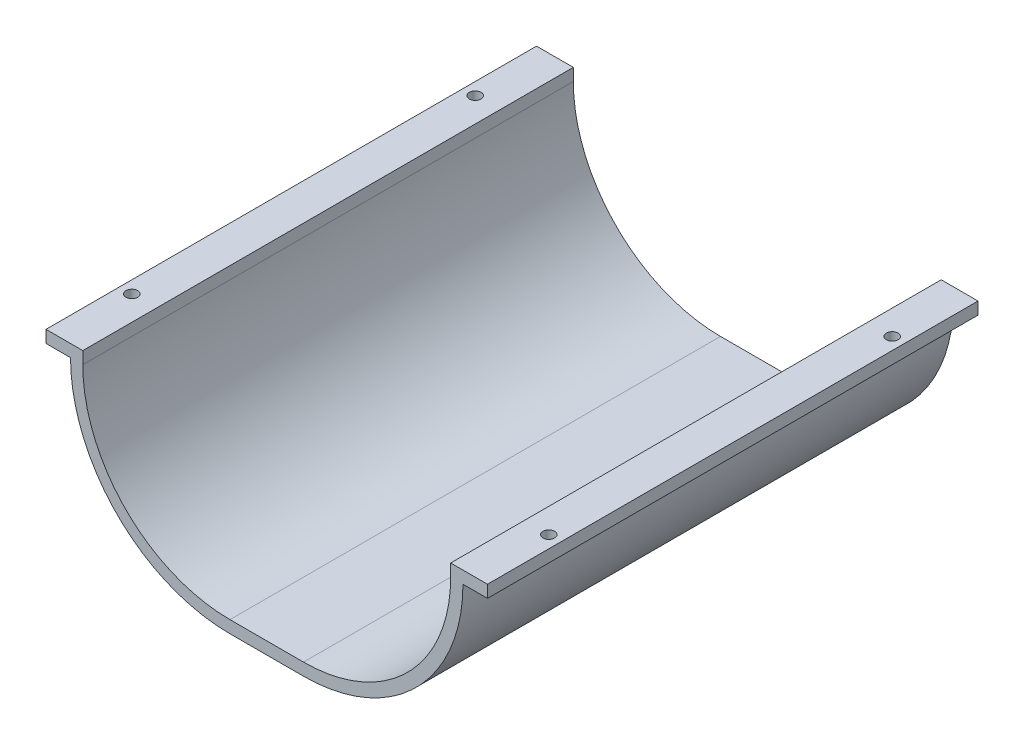
ISO-10303-21;
HEADER;
FILE_DESCRIPTION(('STEP AP214'),'2;1');
FILE_NAME('part.step','',(''),(''),'','','');
FILE_SCHEMA(('AUTOMOTIVE_DESIGN { 1 0 10303 214 1 1 1 1 }'));
ENDSEC;
DATA;
#1=APPLICATION_CONTEXT('core data for automotive mechanical design processes');
#2=APPLICATION_PROTOCOL_DEFINITION('international standard','automotive_design',2000,#1);
#3=PRODUCT_CONTEXT('',#1,'mechanical');
#4=PRODUCT('Part','Part','',(#3));
#5=PRODUCT_RELATED_PRODUCT_CATEGORY('part','',(#4));
#6=PRODUCT_DEFINITION_FORMATION('','',#4);
#7=PRODUCT_DEFINITION_CONTEXT('part definition',#1,'design');
#8=PRODUCT_DEFINITION('design','',#6,#7);
#9=PRODUCT_DEFINITION_SHAPE('','',#8);
#10=(LENGTH_UNIT() NAMED_UNIT(*) SI_UNIT(.MILLI.,.METRE.));
#11=(NAMED_UNIT(*) PLANE_ANGLE_UNIT() SI_UNIT($,.RADIAN.));
#12=(NAMED_UNIT(*) SI_UNIT($,.STERADIAN.) SOLID_ANGLE_UNIT());
#13=UNCERTAINTY_MEASURE_WITH_UNIT(LENGTH_MEASURE(1.E-05),#10,'distance_accuracy_value','');
#14=(GEOMETRIC_REPRESENTATION_CONTEXT(3) GLOBAL_UNCERTAINTY_ASSIGNED_CONTEXT((#13)) GLOBAL_UNIT_ASSIGNED_CONTEXT((#10,
#11,#12)) REPRESENTATION_CONTEXT('',''));
#15=CARTESIAN_POINT('',(0.,0.,0.));
#16=DIRECTION('',(0.,0.,1.));
#17=DIRECTION('',(1.,0.,0.));
#18=AXIS2_PLACEMENT_3D('',#15,#16,#17);
#19=CARTESIAN_POINT('',(-15.,0.,200.));
#20=DIRECTION('',(-1.,0.,0.));
#21=DIRECTION('',(0.,0.,1.));
#22=AXIS2_PLACEMENT_3D('',#19,#20,#21);
#23=PLANE('',#22);
#24=DIRECTION('',(0.,1.,0.));
#25=VECTOR('',#24,1.);
#26=CARTESIAN_POINT('',(-15.,0.,0.));
#27=LINE('',#26,#25);
#28=CARTESIAN_POINT('',(-15.,60.,0.));
#29=VERTEX_POINT('',#28);
#30=CARTESIAN_POINT('',(-15.,65.,0.));
#31=VERTEX_POINT('',#30);
#32=EDGE_CURVE('E168',#29,#31,#27,.T.);
#33=ORIENTED_EDGE('',*,*,#32,.F.);
#34=DIRECTION('',(0.,0.,-1.));
#35=VECTOR('',#34,1.);
#36=CARTESIAN_POINT('',(-15.,60.,200.));
#37=LINE('',#36,#35);
#38=CARTESIAN_POINT('',(-15.,60.,200.));
#39=VERTEX_POINT('',#38);
#40=EDGE_CURVE('E11',#39,#29,#37,.T.);
#41=ORIENTED_EDGE('',*,*,#40,.F.);
#42=DIRECTION('',(0.,1.,0.));
#43=VECTOR('',#42,1.);
#44=CARTESIAN_POINT('',(-15.,0.,200.));
#45=LINE('',#44,#43);
#46=CARTESIAN_POINT('',(-15.,65.,200.));
#47=VERTEX_POINT('',#46);
#48=EDGE_CURVE('E203',#39,#47,#45,.T.);
#49=ORIENTED_EDGE('',*,*,#48,.T.);
#50=DIRECTION('',(0.,0.,-1.));
#51=VECTOR('',#50,1.);
#52=CARTESIAN_POINT('',(-15.,65.,200.));
#53=LINE('',#52,#51);
#54=EDGE_CURVE('E109',#47,#31,#53,.T.);
#55=ORIENTED_EDGE('',*,*,#54,.T.);
#56=EDGE_LOOP('',(#33,#41,#49,#55));
#57=FACE_BOUND('',#56,.T.);
#58=ADVANCED_FACE('F40',(#57),#23,.T.);
#59=CARTESIAN_POINT('',(-2.53963516883007E-12,60.0000000000006,200.));
#60=DIRECTION('',(0.,-1.,0.));
#61=DIRECTION('',(1.,0.,0.));
#62=AXIS2_PLACEMENT_3D('',#59,#60,#61);
#63=PLANE('',#62);
#64=CARTESIAN_POINT('',(-10.,60.0000000000002,170.));
#65=DIRECTION('',(0.,-1.,0.));
#66=DIRECTION('',(1.,0.,0.));
#67=AXIS2_PLACEMENT_3D('',#64,#65,#66);
#68=CIRCLE('',#67,2.38125);
#69=CARTESIAN_POINT('',(-7.61875,60.0000000000003,170.));
#70=VERTEX_POINT('',#69);
#71=EDGE_CURVE('E284',#70,#70,#68,.T.);
#72=ORIENTED_EDGE('',*,*,#71,.F.);
#73=EDGE_LOOP('',(#72));
#74=FACE_BOUND('',#73,.T.);
#75=CARTESIAN_POINT('',(-10.,60.0000000000002,30.));
#76=DIRECTION('',(0.,-1.,0.));
#77=DIRECTION('',(1.,0.,0.));
#78=AXIS2_PLACEMENT_3D('',#75,#76,#77);
#79=CIRCLE('',#78,2.38125);
#80=CARTESIAN_POINT('',(-7.61875000000002,60.0000000000003,30.));
#81=VERTEX_POINT('',#80);
#82=EDGE_CURVE('E287',#81,#81,#79,.T.);
#83=ORIENTED_EDGE('',*,*,#82,.F.);
#84=EDGE_LOOP('',(#83));
#85=FACE_BOUND('',#84,.T.);
#86=DIRECTION('',(-1.,0.,0.));
#87=VECTOR('',#86,1.);
#88=CARTESIAN_POINT('',(-2.53963516883007E-12,60.0000000000006,0.));
#89=LINE('',#88,#87);
#90=CARTESIAN_POINT('',(-5.,60.0000000000004,0.));
#91=VERTEX_POINT('',#90);
#92=EDGE_CURVE('E171',#91,#29,#89,.T.);
#93=ORIENTED_EDGE('',*,*,#92,.F.);
#94=DIRECTION('',(0.,0.,-1.));
#95=VECTOR('',#94,1.);
#96=CARTESIAN_POINT('',(-5.,60.0000000000004,200.));
#97=LINE('',#96,#95);
#98=CARTESIAN_POINT('',(-5.,60.0000000000004,200.));
#99=VERTEX_POINT('',#98);
#100=EDGE_CURVE('E48',#99,#91,#97,.T.);
#101=ORIENTED_EDGE('',*,*,#100,.F.);
#102=DIRECTION('',(-1.,0.,0.));
#103=VECTOR('',#102,1.);
#104=CARTESIAN_POINT('',(-2.53963516883007E-12,60.0000000000006,200.));
#105=LINE('',#104,#103);
#106=EDGE_CURVE('E275',#99,#39,#105,.T.);
#107=ORIENTED_EDGE('',*,*,#106,.T.);
#108=ORIENTED_EDGE('',*,*,#40,.T.);
#109=EDGE_LOOP('',(#93,#101,#107,#108));
#110=FACE_BOUND('',#109,.T.);
#111=ADVANCED_FACE('F235',(#74,#85,#110),#63,.T.);
#112=CARTESIAN_POINT('',(60.,60.,200.));
#113=DIRECTION('',(0.,0.,-1.));
#114=DIRECTION('',(-1.,0.,0.));
#115=AXIS2_PLACEMENT_3D('',#112,#113,#114);
#116=CYLINDRICAL_SURFACE('',#115,65.);
#117=CARTESIAN_POINT('',(60.,60.,0.));
#118=DIRECTION('',(0.,0.,1.));
#119=DIRECTION('',(1.,0.,0.));
#120=AXIS2_PLACEMENT_3D('',#117,#118,#119);
#121=CIRCLE('',#120,65.);
#122=CARTESIAN_POINT('',(60.0000000000004,-5.,0.));
#123=VERTEX_POINT('',#122);
#124=EDGE_CURVE('E175',#123,#91,#121,.F.);
#125=ORIENTED_EDGE('',*,*,#124,.F.);
#126=DIRECTION('',(0.,0.,-1.));
#127=VECTOR('',#126,1.);
#128=CARTESIAN_POINT('',(60.0000000000004,-5.,200.));
#129=LINE('',#128,#127);
#130=CARTESIAN_POINT('',(60.0000000000004,-5.,200.));
#131=VERTEX_POINT('',#130);
#132=EDGE_CURVE('E224',#131,#123,#129,.T.);
#133=ORIENTED_EDGE('',*,*,#132,.F.);
#134=CARTESIAN_POINT('',(60.,60.,200.));
#135=DIRECTION('',(0.,0.,1.));
#136=DIRECTION('',(1.,0.,0.));
#137=AXIS2_PLACEMENT_3D('',#134,#135,#136);
#138=CIRCLE('',#137,65.);
#139=EDGE_CURVE('E231',#131,#99,#138,.F.);
#140=ORIENTED_EDGE('',*,*,#139,.T.);
#141=ORIENTED_EDGE('',*,*,#100,.T.);
#142=EDGE_LOOP('',(#125,#133,#140,#141));
#143=FACE_BOUND('',#142,.T.);
#144=ADVANCED_FACE('F229',(#143),#116,.T.);
#145=CARTESIAN_POINT('',(0.,-5.00000000000001,200.));
#146=DIRECTION('',(0.,1.,0.));
#147=DIRECTION('',(-1.,0.,0.));
#148=AXIS2_PLACEMENT_3D('',#145,#146,#147);
#149=PLANE('',#148);
#150=DIRECTION('',(1.,0.,0.));
#151=VECTOR('',#150,1.);
#152=CARTESIAN_POINT('',(0.,-5.00000000000001,0.));
#153=LINE('',#152,#151);
#154=CARTESIAN_POINT('',(89.9999999999996,-5.,0.));
#155=VERTEX_POINT('',#154);
#156=EDGE_CURVE('E178',#123,#155,#153,.T.);
#157=ORIENTED_EDGE('',*,*,#156,.T.);
#158=DIRECTION('',(0.,0.,-1.));
#159=VECTOR('',#158,1.);
#160=CARTESIAN_POINT('',(89.9999999999996,-5.,200.));
#161=LINE('',#160,#159);
#162=CARTESIAN_POINT('',(89.9999999999996,-5.,200.));
#163=VERTEX_POINT('',#162);
#164=EDGE_CURVE('E221',#163,#155,#161,.T.);
#165=ORIENTED_EDGE('',*,*,#164,.F.);
#166=DIRECTION('',(1.,0.,0.));
#167=VECTOR('',#166,1.);
#168=CARTESIAN_POINT('',(0.,-5.00000000000001,200.));
#169=LINE('',#168,#167);
#170=EDGE_CURVE('E252',#131,#163,#169,.T.);
#171=ORIENTED_EDGE('',*,*,#170,.F.);
#172=ORIENTED_EDGE('',*,*,#132,.T.);
#173=EDGE_LOOP('',(#157,#165,#171,#172));
#174=FACE_BOUND('',#173,.T.);
#175=ADVANCED_FACE('F243',(#174),#149,.F.);
#176=CARTESIAN_POINT('',(90.,60.,200.));
#177=DIRECTION('',(0.,0.,-1.));
#178=DIRECTION('',(-1.,0.,0.));
#179=AXIS2_PLACEMENT_3D('',#176,#177,#178);
#180=CYLINDRICAL_SURFACE('',#179,65.);
#181=CARTESIAN_POINT('',(90.,60.,0.));
#182=DIRECTION('',(0.,0.,1.));
#183=DIRECTION('',(1.,0.,0.));
#184=AXIS2_PLACEMENT_3D('',#181,#182,#183);
#185=CIRCLE('',#184,65.);
#186=CARTESIAN_POINT('',(155.,60.0000000000004,0.));
#187=VERTEX_POINT('',#186);
#188=EDGE_CURVE('E180',#155,#187,#185,.T.);
#189=ORIENTED_EDGE('',*,*,#188,.T.);
#190=DIRECTION('',(0.,0.,-1.));
#191=VECTOR('',#190,1.);
#192=CARTESIAN_POINT('',(155.,60.0000000000004,200.));
#193=LINE('',#192,#191);
#194=CARTESIAN_POINT('',(155.,60.0000000000004,200.));
#195=VERTEX_POINT('',#194);
#196=EDGE_CURVE('E218',#195,#187,#193,.T.);
#197=ORIENTED_EDGE('',*,*,#196,.F.);
#198=CARTESIAN_POINT('',(90.,60.,200.));
#199=DIRECTION('',(0.,0.,1.));
#200=DIRECTION('',(1.,0.,0.));
#201=AXIS2_PLACEMENT_3D('',#198,#199,#200);
#202=CIRCLE('',#201,65.);
#203=EDGE_CURVE('E249',#163,#195,#202,.T.);
#204=ORIENTED_EDGE('',*,*,#203,.F.);
#205=ORIENTED_EDGE('',*,*,#164,.T.);
#206=EDGE_LOOP('',(#189,#197,#204,#205));
#207=FACE_BOUND('',#206,.T.);
#208=ADVANCED_FACE('F247',(#207),#180,.T.);
#209=CARTESIAN_POINT('',(2.62290189567724E-12,60.0000000000072,200.));
#210=DIRECTION('',(0.,1.,0.));
#211=DIRECTION('',(-1.,0.,0.));
#212=AXIS2_PLACEMENT_3D('',#209,#210,#211);
#213=PLANE('',#212);
#214=CARTESIAN_POINT('',(160.,60.0000000000002,30.));
#215=DIRECTION('',(0.,1.,0.));
#216=DIRECTION('',(-1.,0.,0.));
#217=AXIS2_PLACEMENT_3D('',#214,#215,#216);
#218=CIRCLE('',#217,2.38125000000001);
#219=CARTESIAN_POINT('',(157.61875,60.0000000000003,30.));
#220=VERTEX_POINT('',#219);
#221=EDGE_CURVE('E172',#220,#220,#218,.T.);
#222=ORIENTED_EDGE('',*,*,#221,.T.);
#223=EDGE_LOOP('',(#222));
#224=FACE_BOUND('',#223,.T.);
#225=CARTESIAN_POINT('',(160.,60.0000000000002,170.));
#226=DIRECTION('',(0.,1.,0.));
#227=DIRECTION('',(-1.,0.,0.));
#228=AXIS2_PLACEMENT_3D('',#225,#226,#227);
#229=CIRCLE('',#228,2.38125);
#230=CARTESIAN_POINT('',(157.61875,60.0000000000003,170.));
#231=VERTEX_POINT('',#230);
#232=EDGE_CURVE('E281',#231,#231,#229,.T.);
#233=ORIENTED_EDGE('',*,*,#232,.T.);
#234=EDGE_LOOP('',(#233));
#235=FACE_BOUND('',#234,.T.);
#236=DIRECTION('',(1.,0.,0.));
#237=VECTOR('',#236,1.);
#238=CARTESIAN_POINT('',(2.62290189567724E-12,60.0000000000072,0.));
#239=LINE('',#238,#237);
#240=CARTESIAN_POINT('',(165.,60.,0.));
#241=VERTEX_POINT('',#240);
#242=EDGE_CURVE('E182',#187,#241,#239,.T.);
#243=ORIENTED_EDGE('',*,*,#242,.T.);
#244=DIRECTION('',(0.,0.,-1.));
#245=VECTOR('',#244,1.);
#246=CARTESIAN_POINT('',(165.,60.,200.));
#247=LINE('',#246,#245);
#248=CARTESIAN_POINT('',(165.,60.,200.));
#249=VERTEX_POINT('',#248);
#250=EDGE_CURVE('E215',#249,#241,#247,.T.);
#251=ORIENTED_EDGE('',*,*,#250,.F.);
#252=DIRECTION('',(1.,0.,0.));
#253=VECTOR('',#252,1.);
#254=CARTESIAN_POINT('',(2.62290189567724E-12,60.0000000000072,200.));
#255=LINE('',#254,#253);
#256=EDGE_CURVE('E251',#195,#249,#255,.T.);
#257=ORIENTED_EDGE('',*,*,#256,.F.);
#258=ORIENTED_EDGE('',*,*,#196,.T.);
#259=EDGE_LOOP('',(#243,#251,#257,#258));
#260=FACE_BOUND('',#259,.T.);
#261=ADVANCED_FACE('F340',(#224,#235,#260),#213,.F.);
#262=CARTESIAN_POINT('',(165.,0.,200.));
#263=DIRECTION('',(-1.,0.,0.));
#264=DIRECTION('',(0.,0.,1.));
#265=AXIS2_PLACEMENT_3D('',#262,#263,#264);
#266=PLANE('',#265);
#267=DIRECTION('',(0.,1.,0.));
#268=VECTOR('',#267,1.);
#269=CARTESIAN_POINT('',(165.,0.,0.));
#270=LINE('',#269,#268);
#271=CARTESIAN_POINT('',(165.,65.,0.));
#272=VERTEX_POINT('',#271);
#273=EDGE_CURVE('E184',#241,#272,#270,.T.);
#274=ORIENTED_EDGE('',*,*,#273,.T.);
#275=DIRECTION('',(0.,0.,-1.));
#276=VECTOR('',#275,1.);
#277=CARTESIAN_POINT('',(165.,65.,200.));
#278=LINE('',#277,#276);
#279=CARTESIAN_POINT('',(165.,65.,200.));
#280=VERTEX_POINT('',#279);
#281=EDGE_CURVE('E213',#280,#272,#278,.T.);
#282=ORIENTED_EDGE('',*,*,#281,.F.);
#283=DIRECTION('',(0.,1.,0.));
#284=VECTOR('',#283,1.);
#285=CARTESIAN_POINT('',(165.,0.,200.));
#286=LINE('',#285,#284);
#287=EDGE_CURVE('E254',#249,#280,#286,.T.);
#288=ORIENTED_EDGE('',*,*,#287,.F.);
#289=ORIENTED_EDGE('',*,*,#250,.T.);
#290=EDGE_LOOP('',(#274,#282,#288,#289));
#291=FACE_BOUND('',#290,.T.);
#292=ADVANCED_FACE('F343',(#291),#266,.F.);
#293=CARTESIAN_POINT('',(0.,65.,200.));
#294=DIRECTION('',(0.,1.,0.));
#295=DIRECTION('',(0.,0.,1.));
#296=AXIS2_PLACEMENT_3D('',#293,#294,#295);
#297=PLANE('',#296);
#298=CARTESIAN_POINT('',(160.,65.,30.));
#299=DIRECTION('',(0.,1.,0.));
#300=DIRECTION('',(0.,0.,1.));
#301=AXIS2_PLACEMENT_3D('',#298,#299,#300);
#302=CIRCLE('',#301,2.38125000000001);
#303=CARTESIAN_POINT('',(160.,65.,32.38125));
#304=VERTEX_POINT('',#303);
#305=EDGE_CURVE('E294',#304,#304,#302,.T.);
#306=ORIENTED_EDGE('',*,*,#305,.F.);
#307=EDGE_LOOP('',(#306));
#308=FACE_BOUND('',#307,.T.);
#309=CARTESIAN_POINT('',(160.,65.,170.));
#310=DIRECTION('',(0.,1.,0.));
#311=DIRECTION('',(0.,0.,1.));
#312=AXIS2_PLACEMENT_3D('',#309,#310,#311);
#313=CIRCLE('',#312,2.38125);
#314=CARTESIAN_POINT('',(160.,65.,172.38125));
#315=VERTEX_POINT('',#314);
#316=EDGE_CURVE('E297',#315,#315,#313,.T.);
#317=ORIENTED_EDGE('',*,*,#316,.F.);
#318=EDGE_LOOP('',(#317));
#319=FACE_BOUND('',#318,.T.);
#320=DIRECTION('',(1.,0.,0.));
#321=VECTOR('',#320,1.);
#322=CARTESIAN_POINT('',(0.,65.,0.));
#323=LINE('',#322,#321);
#324=CARTESIAN_POINT('',(150.,65.,0.));
#325=VERTEX_POINT('',#324);
#326=EDGE_CURVE('E187',#325,#272,#323,.T.);
#327=ORIENTED_EDGE('',*,*,#326,.F.);
#328=DIRECTION('',(0.,0.,-1.));
#329=VECTOR('',#328,1.);
#330=CARTESIAN_POINT('',(150.,65.,200.));
#331=LINE('',#330,#329);
#332=CARTESIAN_POINT('',(150.,65.,200.));
#333=VERTEX_POINT('',#332);
#334=EDGE_CURVE('E211',#333,#325,#331,.T.);
#335=ORIENTED_EDGE('',*,*,#334,.F.);
#336=DIRECTION('',(1.,0.,0.));
#337=VECTOR('',#336,1.);
#338=CARTESIAN_POINT('',(0.,65.,200.));
#339=LINE('',#338,#337);
#340=EDGE_CURVE('E260',#333,#280,#339,.T.);
#341=ORIENTED_EDGE('',*,*,#340,.T.);
#342=ORIENTED_EDGE('',*,*,#281,.T.);
#343=EDGE_LOOP('',(#327,#335,#341,#342));
#344=FACE_BOUND('',#343,.T.);
#345=ADVANCED_FACE('F347',(#308,#319,#344),#297,.T.);
#346=CARTESIAN_POINT('',(150.,0.,200.));
#347=DIRECTION('',(-1.,0.,0.));
#348=DIRECTION('',(0.,0.,1.));
#349=AXIS2_PLACEMENT_3D('',#346,#347,#348);
#350=PLANE('',#349);
#351=DIRECTION('',(0.,1.,0.));
#352=VECTOR('',#351,1.);
#353=CARTESIAN_POINT('',(150.,0.,0.));
#354=LINE('',#353,#352);
#355=CARTESIAN_POINT('',(150.,60.0000000000004,0.));
#356=VERTEX_POINT('',#355);
#357=EDGE_CURVE('E190',#356,#325,#354,.T.);
#358=ORIENTED_EDGE('',*,*,#357,.F.);
#359=DIRECTION('',(0.,0.,-1.));
#360=VECTOR('',#359,1.);
#361=CARTESIAN_POINT('',(150.,60.0000000000004,200.));
#362=LINE('',#361,#360);
#363=CARTESIAN_POINT('',(150.,60.0000000000004,200.));
#364=VERTEX_POINT('',#363);
#365=EDGE_CURVE('E209',#364,#356,#362,.T.);
#366=ORIENTED_EDGE('',*,*,#365,.F.);
#367=DIRECTION('',(0.,1.,0.));
#368=VECTOR('',#367,1.);
#369=CARTESIAN_POINT('',(150.,0.,200.));
#370=LINE('',#369,#368);
#371=EDGE_CURVE('E263',#364,#333,#370,.T.);
#372=ORIENTED_EDGE('',*,*,#371,.T.);
#373=ORIENTED_EDGE('',*,*,#334,.T.);
#374=EDGE_LOOP('',(#358,#366,#372,#373));
#375=FACE_BOUND('',#374,.T.);
#376=ADVANCED_FACE('F351',(#375),#350,.T.);
#377=CARTESIAN_POINT('',(90.,60.,200.));
#378=DIRECTION('',(0.,0.,-1.));
#379=DIRECTION('',(-1.,0.,0.));
#380=AXIS2_PLACEMENT_3D('',#377,#378,#379);
#381=CYLINDRICAL_SURFACE('',#380,60.);
#382=CARTESIAN_POINT('',(90.,60.,0.));
#383=DIRECTION('',(0.,0.,1.));
#384=DIRECTION('',(1.,0.,0.));
#385=AXIS2_PLACEMENT_3D('',#382,#383,#384);
#386=CIRCLE('',#385,60.);
#387=CARTESIAN_POINT('',(89.9999999999996,0.,0.));
#388=VERTEX_POINT('',#387);
#389=EDGE_CURVE('E193',#388,#356,#386,.T.);
#390=ORIENTED_EDGE('',*,*,#389,.F.);
#391=DIRECTION('',(0.,0.,-1.));
#392=VECTOR('',#391,1.);
#393=CARTESIAN_POINT('',(89.9999999999996,0.,200.));
#394=LINE('',#393,#392);
#395=CARTESIAN_POINT('',(89.9999999999996,0.,200.));
#396=VERTEX_POINT('',#395);
#397=EDGE_CURVE('E207',#396,#388,#394,.T.);
#398=ORIENTED_EDGE('',*,*,#397,.F.);
#399=CARTESIAN_POINT('',(90.,60.,200.));
#400=DIRECTION('',(0.,0.,1.));
#401=DIRECTION('',(1.,0.,0.));
#402=AXIS2_PLACEMENT_3D('',#399,#400,#401);
#403=CIRCLE('',#402,60.);
#404=EDGE_CURVE('E266',#396,#364,#403,.T.);
#405=ORIENTED_EDGE('',*,*,#404,.T.);
#406=ORIENTED_EDGE('',*,*,#365,.T.);
#407=EDGE_LOOP('',(#390,#398,#405,#406));
#408=FACE_BOUND('',#407,.T.);
#409=ADVANCED_FACE('F355',(#408),#381,.F.);
#410=CARTESIAN_POINT('',(0.,0.,200.));
#411=DIRECTION('',(0.,1.,0.));
#412=DIRECTION('',(0.,0.,1.));
#413=AXIS2_PLACEMENT_3D('',#410,#411,#412);
#414=PLANE('',#413);
#415=DIRECTION('',(1.,0.,0.));
#416=VECTOR('',#415,1.);
#417=CARTESIAN_POINT('',(0.,0.,0.));
#418=LINE('',#417,#416);
#419=CARTESIAN_POINT('',(60.0000000000004,0.,0.));
#420=VERTEX_POINT('',#419);
#421=EDGE_CURVE('E196',#420,#388,#418,.T.);
#422=ORIENTED_EDGE('',*,*,#421,.F.);
#423=DIRECTION('',(0.,0.,-1.));
#424=VECTOR('',#423,1.);
#425=CARTESIAN_POINT('',(60.0000000000004,0.,200.));
#426=LINE('',#425,#424);
#427=CARTESIAN_POINT('',(60.0000000000004,0.,200.));
#428=VERTEX_POINT('',#427);
#429=EDGE_CURVE('E160',#428,#420,#426,.T.);
#430=ORIENTED_EDGE('',*,*,#429,.F.);
#431=DIRECTION('',(1.,0.,0.));
#432=VECTOR('',#431,1.);
#433=CARTESIAN_POINT('',(0.,0.,200.));
#434=LINE('',#433,#432);
#435=EDGE_CURVE('E153',#428,#396,#434,.T.);
#436=ORIENTED_EDGE('',*,*,#435,.T.);
#437=ORIENTED_EDGE('',*,*,#397,.T.);
#438=EDGE_LOOP('',(#422,#430,#436,#437));
#439=FACE_BOUND('',#438,.T.);
#440=ADVANCED_FACE('F270',(#439),#414,.T.);
#441=CARTESIAN_POINT('',(60.,60.,200.));
#442=DIRECTION('',(0.,0.,-1.));
#443=DIRECTION('',(-1.,0.,0.));
#444=AXIS2_PLACEMENT_3D('',#441,#442,#443);
#445=CYLINDRICAL_SURFACE('',#444,60.);
#446=CARTESIAN_POINT('',(60.,60.,0.));
#447=DIRECTION('',(0.,0.,1.));
#448=DIRECTION('',(1.,0.,0.));
#449=AXIS2_PLACEMENT_3D('',#446,#447,#448);
#450=CIRCLE('',#449,60.);
#451=CARTESIAN_POINT('',(0.,60.0000000000004,0.));
#452=VERTEX_POINT('',#451);
#453=EDGE_CURVE('E159',#420,#452,#450,.F.);
#454=ORIENTED_EDGE('',*,*,#453,.T.);
#455=DIRECTION('',(0.,0.,-1.));
#456=VECTOR('',#455,1.);
#457=CARTESIAN_POINT('',(0.,60.0000000000004,200.));
#458=LINE('',#457,#456);
#459=CARTESIAN_POINT('',(0.,60.0000000000004,200.));
#460=VERTEX_POINT('',#459);
#461=EDGE_CURVE('E156',#460,#452,#458,.T.);
#462=ORIENTED_EDGE('',*,*,#461,.F.);
#463=CARTESIAN_POINT('',(60.,60.,200.));
#464=DIRECTION('',(0.,0.,1.));
#465=DIRECTION('',(1.,0.,0.));
#466=AXIS2_PLACEMENT_3D('',#463,#464,#465);
#467=CIRCLE('',#466,60.);
#468=EDGE_CURVE('E146',#428,#460,#467,.F.);
#469=ORIENTED_EDGE('',*,*,#468,.F.);
#470=ORIENTED_EDGE('',*,*,#429,.T.);
#471=EDGE_LOOP('',(#454,#462,#469,#470));
#472=FACE_BOUND('',#471,.T.);
#473=ADVANCED_FACE('F157',(#472),#445,.F.);
#474=CARTESIAN_POINT('',(0.,0.,200.));
#475=DIRECTION('',(-1.,0.,0.));
#476=DIRECTION('',(0.,0.,1.));
#477=AXIS2_PLACEMENT_3D('',#474,#475,#476);
#478=PLANE('',#477);
#479=DIRECTION('',(0.,1.,0.));
#480=VECTOR('',#479,1.);
#481=CARTESIAN_POINT('',(0.,0.,0.));
#482=LINE('',#481,#480);
#483=CARTESIAN_POINT('',(0.,65.,0.));
#484=VERTEX_POINT('',#483);
#485=EDGE_CURVE('E102',#452,#484,#482,.T.);
#486=ORIENTED_EDGE('',*,*,#485,.T.);
#487=DIRECTION('',(0.,0.,-1.));
#488=VECTOR('',#487,1.);
#489=CARTESIAN_POINT('',(0.,65.,200.));
#490=LINE('',#489,#488);
#491=CARTESIAN_POINT('',(0.,65.,200.));
#492=VERTEX_POINT('',#491);
#493=EDGE_CURVE('E161',#492,#484,#490,.T.);
#494=ORIENTED_EDGE('',*,*,#493,.F.);
#495=DIRECTION('',(0.,1.,0.));
#496=VECTOR('',#495,1.);
#497=CARTESIAN_POINT('',(0.,0.,200.));
#498=LINE('',#497,#496);
#499=EDGE_CURVE('E150',#460,#492,#498,.T.);
#500=ORIENTED_EDGE('',*,*,#499,.F.);
#501=ORIENTED_EDGE('',*,*,#461,.T.);
#502=EDGE_LOOP('',(#486,#494,#500,#501));
#503=FACE_BOUND('',#502,.T.);
#504=ADVANCED_FACE('F163',(#503),#478,.F.);
#505=CARTESIAN_POINT('',(0.,65.,200.));
#506=DIRECTION('',(0.,-1.,0.));
#507=DIRECTION('',(0.,0.,-1.));
#508=AXIS2_PLACEMENT_3D('',#505,#506,#507);
#509=PLANE('',#508);
#510=CARTESIAN_POINT('',(-10.,65.,170.));
#511=DIRECTION('',(0.,1.,0.));
#512=DIRECTION('',(0.,0.,1.));
#513=AXIS2_PLACEMENT_3D('',#510,#511,#512);
#514=CIRCLE('',#513,2.38125);
#515=CARTESIAN_POINT('',(-10.,65.,172.38125));
#516=VERTEX_POINT('',#515);
#517=EDGE_CURVE('E293',#516,#516,#514,.T.);
#518=ORIENTED_EDGE('',*,*,#517,.F.);
#519=EDGE_LOOP('',(#518));
#520=FACE_BOUND('',#519,.T.);
#521=CARTESIAN_POINT('',(-10.,65.,30.));
#522=DIRECTION('',(0.,1.,0.));
#523=DIRECTION('',(0.,0.,1.));
#524=AXIS2_PLACEMENT_3D('',#521,#522,#523);
#525=CIRCLE('',#524,2.38125);
#526=CARTESIAN_POINT('',(-10.,65.,32.38125));
#527=VERTEX_POINT('',#526);
#528=EDGE_CURVE('E290',#527,#527,#525,.T.);
#529=ORIENTED_EDGE('',*,*,#528,.F.);
#530=EDGE_LOOP('',(#529));
#531=FACE_BOUND('',#530,.T.);
#532=DIRECTION('',(-1.,0.,0.));
#533=VECTOR('',#532,1.);
#534=CARTESIAN_POINT('',(0.,65.,0.));
#535=LINE('',#534,#533);
#536=EDGE_CURVE('E201',#484,#31,#535,.T.);
#537=ORIENTED_EDGE('',*,*,#536,.T.);
#538=ORIENTED_EDGE('',*,*,#54,.F.);
#539=DIRECTION('',(-1.,0.,0.));
#540=VECTOR('',#539,1.);
#541=CARTESIAN_POINT('',(0.,65.,200.));
#542=LINE('',#541,#540);
#543=EDGE_CURVE('E56',#492,#47,#542,.T.);
#544=ORIENTED_EDGE('',*,*,#543,.F.);
#545=ORIENTED_EDGE('',*,*,#493,.T.);
#546=EDGE_LOOP('',(#537,#538,#544,#545));
#547=FACE_BOUND('',#546,.T.);
#548=ADVANCED_FACE('F274',(#520,#531,#547),#509,.F.);
#549=CARTESIAN_POINT('',(0.,0.,200.));
#550=DIRECTION('',(0.,0.,1.));
#551=DIRECTION('',(1.,0.,0.));
#552=AXIS2_PLACEMENT_3D('',#549,#550,#551);
#553=PLANE('',#552);
#554=ORIENTED_EDGE('',*,*,#48,.F.);
#555=ORIENTED_EDGE('',*,*,#106,.F.);
#556=ORIENTED_EDGE('',*,*,#139,.F.);
#557=ORIENTED_EDGE('',*,*,#170,.T.);
#558=ORIENTED_EDGE('',*,*,#203,.T.);
#559=ORIENTED_EDGE('',*,*,#256,.T.);
#560=ORIENTED_EDGE('',*,*,#287,.T.);
#561=ORIENTED_EDGE('',*,*,#340,.F.);
#562=ORIENTED_EDGE('',*,*,#371,.F.);
#563=ORIENTED_EDGE('',*,*,#404,.F.);
#564=ORIENTED_EDGE('',*,*,#435,.F.);
#565=ORIENTED_EDGE('',*,*,#468,.T.);
#566=ORIENTED_EDGE('',*,*,#499,.T.);
#567=ORIENTED_EDGE('',*,*,#543,.T.);
#568=EDGE_LOOP('',(#554,#555,#556,#557,#558,#559,#560,#561,#562,#563,#564,#565,#566,#567));
#569=FACE_BOUND('',#568,.T.);
#570=ADVANCED_FACE('F148',(#569),#553,.T.);
#571=CARTESIAN_POINT('',(0.,0.,0.));
#572=DIRECTION('',(0.,0.,1.));
#573=DIRECTION('',(1.,0.,0.));
#574=AXIS2_PLACEMENT_3D('',#571,#572,#573);
#575=PLANE('',#574);
#576=ORIENTED_EDGE('',*,*,#32,.T.);
#577=ORIENTED_EDGE('',*,*,#536,.F.);
#578=ORIENTED_EDGE('',*,*,#485,.F.);
#579=ORIENTED_EDGE('',*,*,#453,.F.);
#580=ORIENTED_EDGE('',*,*,#421,.T.);
#581=ORIENTED_EDGE('',*,*,#389,.T.);
#582=ORIENTED_EDGE('',*,*,#357,.T.);
#583=ORIENTED_EDGE('',*,*,#326,.T.);
#584=ORIENTED_EDGE('',*,*,#273,.F.);
#585=ORIENTED_EDGE('',*,*,#242,.F.);
#586=ORIENTED_EDGE('',*,*,#188,.F.);
#587=ORIENTED_EDGE('',*,*,#156,.F.);
#588=ORIENTED_EDGE('',*,*,#124,.T.);
#589=ORIENTED_EDGE('',*,*,#92,.T.);
#590=EDGE_LOOP('',(#576,#577,#578,#579,#580,#581,#582,#583,#584,#585,#586,#587,#588,#589));
#591=FACE_BOUND('',#590,.T.);
#592=ADVANCED_FACE('F238',(#591),#575,.F.);
#593=CARTESIAN_POINT('',(-10.,-135.,30.));
#594=DIRECTION('',(0.,1.,0.));
#595=DIRECTION('',(0.,0.,1.));
#596=AXIS2_PLACEMENT_3D('',#593,#594,#595);
#597=CYLINDRICAL_SURFACE('',#596,2.38125);
#598=ORIENTED_EDGE('',*,*,#82,.T.);
#599=EDGE_LOOP('',(#598));
#600=FACE_BOUND('',#599,.T.);
#601=ORIENTED_EDGE('',*,*,#528,.T.);
#602=EDGE_LOOP('',(#601));
#603=FACE_BOUND('',#602,.T.);
#604=ADVANCED_FACE('F310',(#600,#603),#597,.F.);
#605=CARTESIAN_POINT('',(-10.,-135.,170.));
#606=DIRECTION('',(0.,1.,0.));
#607=DIRECTION('',(0.,0.,1.));
#608=AXIS2_PLACEMENT_3D('',#605,#606,#607);
#609=CYLINDRICAL_SURFACE('',#608,2.38125);
#610=ORIENTED_EDGE('',*,*,#71,.T.);
#611=EDGE_LOOP('',(#610));
#612=FACE_BOUND('',#611,.T.);
#613=ORIENTED_EDGE('',*,*,#517,.T.);
#614=EDGE_LOOP('',(#613));
#615=FACE_BOUND('',#614,.T.);
#616=ADVANCED_FACE('F303',(#612,#615),#609,.F.);
#617=CARTESIAN_POINT('',(160.,-135.,170.));
#618=DIRECTION('',(0.,1.,0.));
#619=DIRECTION('',(0.,0.,1.));
#620=AXIS2_PLACEMENT_3D('',#617,#618,#619);
#621=CYLINDRICAL_SURFACE('',#620,2.38125);
#622=ORIENTED_EDGE('',*,*,#316,.T.);
#623=EDGE_LOOP('',(#622));
#624=FACE_BOUND('',#623,.T.);
#625=ORIENTED_EDGE('',*,*,#232,.F.);
#626=EDGE_LOOP('',(#625));
#627=FACE_BOUND('',#626,.T.);
#628=ADVANCED_FACE('F318',(#624,#627),#621,.F.);
#629=CARTESIAN_POINT('',(160.,-135.,30.));
#630=DIRECTION('',(0.,1.,0.));
#631=DIRECTION('',(0.,0.,1.));
#632=AXIS2_PLACEMENT_3D('',#629,#630,#631);
#633=CYLINDRICAL_SURFACE('',#632,2.38125000000001);
#634=ORIENTED_EDGE('',*,*,#305,.T.);
#635=EDGE_LOOP('',(#634));
#636=FACE_BOUND('',#635,.T.);
#637=ORIENTED_EDGE('',*,*,#221,.F.);
#638=EDGE_LOOP('',(#637));
#639=FACE_BOUND('',#638,.T.);
#640=ADVANCED_FACE('F433',(#636,#639),#633,.F.);
#641=CLOSED_SHELL('',(#58,#111,#144,#175,#208,#261,#292,#345,#376,#409,#440,#473,#504,#548,#570,
#592,#604,#616,#628,#640));
#642=MANIFOLD_SOLID_BREP('B2',#641);
#643=ADVANCED_BREP_SHAPE_REPRESENTATION('',(#18,#642),#14);
#644=SHAPE_DEFINITION_REPRESENTATION(#9,#643);
ENDSEC;
END-ISO-10303-21;
